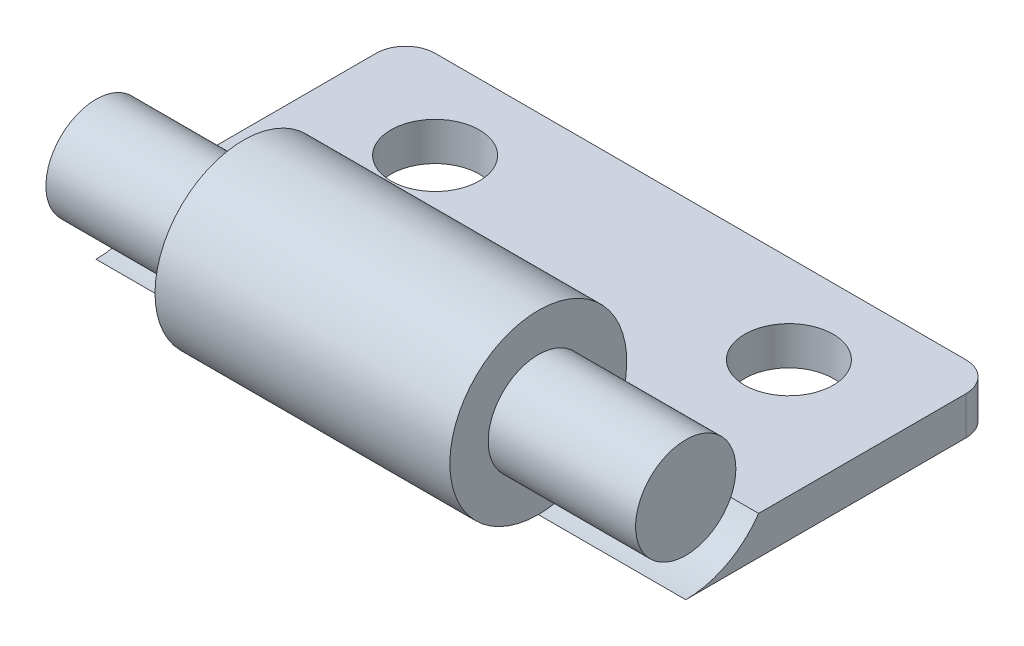
ISO-10303-21;
HEADER;
FILE_DESCRIPTION(('STEP AP214'),'2;1');
FILE_NAME('part.step','',(''),(''),'','','');
FILE_SCHEMA(('AUTOMOTIVE_DESIGN { 1 0 10303 214 1 1 1 1 }'));
ENDSEC;
DATA;
#1=APPLICATION_CONTEXT('core data for automotive mechanical design processes');
#2=APPLICATION_PROTOCOL_DEFINITION('international standard','automotive_design',2000,#1);
#3=PRODUCT_CONTEXT('',#1,'mechanical');
#4=PRODUCT('Part','Part','',(#3));
#5=PRODUCT_RELATED_PRODUCT_CATEGORY('part','',(#4));
#6=PRODUCT_DEFINITION_FORMATION('','',#4);
#7=PRODUCT_DEFINITION_CONTEXT('part definition',#1,'design');
#8=PRODUCT_DEFINITION('design','',#6,#7);
#9=PRODUCT_DEFINITION_SHAPE('','',#8);
#10=(LENGTH_UNIT() NAMED_UNIT(*) SI_UNIT(.MILLI.,.METRE.));
#11=(NAMED_UNIT(*) PLANE_ANGLE_UNIT() SI_UNIT($,.RADIAN.));
#12=(NAMED_UNIT(*) SI_UNIT($,.STERADIAN.) SOLID_ANGLE_UNIT());
#13=UNCERTAINTY_MEASURE_WITH_UNIT(LENGTH_MEASURE(1.E-05),#10,'distance_accuracy_value','');
#14=(GEOMETRIC_REPRESENTATION_CONTEXT(3) GLOBAL_UNCERTAINTY_ASSIGNED_CONTEXT((#13)) GLOBAL_UNIT_ASSIGNED_CONTEXT((#10,
#11,#12)) REPRESENTATION_CONTEXT('',''));
#15=CARTESIAN_POINT('',(0.,0.,0.));
#16=DIRECTION('',(0.,0.,1.));
#17=DIRECTION('',(1.,0.,0.));
#18=AXIS2_PLACEMENT_3D('',#15,#16,#17);
#19=CARTESIAN_POINT('',(10.,1.3,0.));
#20=DIRECTION('',(0.,-1.,0.));
#21=DIRECTION('',(0.,0.,-1.));
#22=AXIS2_PLACEMENT_3D('',#19,#20,#21);
#23=PLANE('',#22);
#24=CARTESIAN_POINT('',(6.,1.3,-7.5));
#25=DIRECTION('',(0.,-1.,0.));
#26=DIRECTION('',(0.,0.,1.));
#27=AXIS2_PLACEMENT_3D('',#24,#25,#26);
#28=CIRCLE('',#27,1.5);
#29=CARTESIAN_POINT('',(6.,1.3,-6.));
#30=VERTEX_POINT('',#29);
#31=EDGE_CURVE('E148',#30,#30,#28,.T.);
#32=ORIENTED_EDGE('',*,*,#31,.T.);
#33=EDGE_LOOP('',(#32));
#34=FACE_BOUND('',#33,.T.);
#35=CARTESIAN_POINT('',(-6.,1.3,-7.5));
#36=DIRECTION('',(0.,1.,0.));
#37=DIRECTION('',(0.,0.,1.));
#38=AXIS2_PLACEMENT_3D('',#35,#36,#37);
#39=CIRCLE('',#38,1.5);
#40=CARTESIAN_POINT('',(-6.,1.3,-6.));
#41=VERTEX_POINT('',#40);
#42=EDGE_CURVE('E144',#41,#41,#39,.T.);
#43=ORIENTED_EDGE('',*,*,#42,.F.);
#44=EDGE_LOOP('',(#43));
#45=FACE_BOUND('',#44,.T.);
#46=DIRECTION('',(-1.,0.,0.));
#47=VECTOR('',#46,1.);
#48=CARTESIAN_POINT('',(10.,1.3,-10.5));
#49=LINE('',#48,#47);
#50=CARTESIAN_POINT('',(9.,1.3,-10.5));
#51=VERTEX_POINT('',#50);
#52=CARTESIAN_POINT('',(-9.,1.3,-10.5));
#53=VERTEX_POINT('',#52);
#54=EDGE_CURVE('E168',#51,#53,#49,.T.);
#55=ORIENTED_EDGE('',*,*,#54,.T.);
#56=CARTESIAN_POINT('',(-9.,1.3,-9.5));
#57=DIRECTION('',(0.,-1.,0.));
#58=DIRECTION('',(0.,0.,-1.));
#59=AXIS2_PLACEMENT_3D('',#56,#57,#58);
#60=CIRCLE('',#59,1.);
#61=CARTESIAN_POINT('',(-10.,1.3,-9.5));
#62=VERTEX_POINT('',#61);
#63=EDGE_CURVE('E155',#53,#62,#60,.F.);
#64=ORIENTED_EDGE('',*,*,#63,.T.);
#65=DIRECTION('',(0.,0.,1.));
#66=VECTOR('',#65,1.);
#67=CARTESIAN_POINT('',(-10.,1.3,0.));
#68=LINE('',#67,#66);
#69=CARTESIAN_POINT('',(-10.,1.3,-2.47184141886166));
#70=VERTEX_POINT('',#69);
#71=EDGE_CURVE('E171',#62,#70,#68,.T.);
#72=ORIENTED_EDGE('',*,*,#71,.T.);
#73=DIRECTION('',(-1.,0.,0.));
#74=VECTOR('',#73,1.);
#75=CARTESIAN_POINT('',(-5.,1.3,-2.47184141886166));
#76=LINE('',#75,#74);
#77=CARTESIAN_POINT('',(-5.,1.3,-2.47184141886166));
#78=VERTEX_POINT('',#77);
#79=EDGE_CURVE('E124',#78,#70,#76,.T.);
#80=ORIENTED_EDGE('',*,*,#79,.F.);
#81=DIRECTION('',(1.,0.,0.));
#82=VECTOR('',#81,1.);
#83=CARTESIAN_POINT('',(-5.,1.3,-2.47184141886166));
#84=LINE('',#83,#82);
#85=CARTESIAN_POINT('',(5.,1.3,-2.47184141886166));
#86=VERTEX_POINT('',#85);
#87=EDGE_CURVE('E131',#78,#86,#84,.T.);
#88=ORIENTED_EDGE('',*,*,#87,.T.);
#89=DIRECTION('',(1.,0.,0.));
#90=VECTOR('',#89,1.);
#91=CARTESIAN_POINT('',(5.,1.3,-2.47184141886166));
#92=LINE('',#91,#90);
#93=CARTESIAN_POINT('',(10.,1.3,-2.47184141886166));
#94=VERTEX_POINT('',#93);
#95=EDGE_CURVE('E177',#86,#94,#92,.T.);
#96=ORIENTED_EDGE('',*,*,#95,.T.);
#97=DIRECTION('',(0.,0.,1.));
#98=VECTOR('',#97,1.);
#99=CARTESIAN_POINT('',(10.,1.3,0.));
#100=LINE('',#99,#98);
#101=CARTESIAN_POINT('',(10.,1.3,-9.5));
#102=VERTEX_POINT('',#101);
#103=EDGE_CURVE('E175',#102,#94,#100,.T.);
#104=ORIENTED_EDGE('',*,*,#103,.F.);
#105=CARTESIAN_POINT('',(9.,1.3,-9.5));
#106=DIRECTION('',(0.,-1.,0.));
#107=DIRECTION('',(0.,0.,-1.));
#108=AXIS2_PLACEMENT_3D('',#105,#106,#107);
#109=CIRCLE('',#108,1.);
#110=EDGE_CURVE('E153',#102,#51,#109,.F.);
#111=ORIENTED_EDGE('',*,*,#110,.T.);
#112=EDGE_LOOP('',(#55,#64,#72,#80,#88,#96,#104,#111));
#113=FACE_BOUND('',#112,.T.);
#114=ADVANCED_FACE('F38',(#34,#45,#113),#23,.F.);
#115=CARTESIAN_POINT('',(10.,0.,0.));
#116=DIRECTION('',(0.,1.,0.));
#117=DIRECTION('',(0.,0.,1.));
#118=AXIS2_PLACEMENT_3D('',#115,#116,#117);
#119=PLANE('',#118);
#120=CARTESIAN_POINT('',(6.,0.,-7.5));
#121=DIRECTION('',(0.,1.,0.));
#122=DIRECTION('',(0.,0.,1.));
#123=AXIS2_PLACEMENT_3D('',#120,#121,#122);
#124=CIRCLE('',#123,1.5);
#125=CARTESIAN_POINT('',(6.,0.,-6.));
#126=VERTEX_POINT('',#125);
#127=EDGE_CURVE('E145',#126,#126,#124,.F.);
#128=ORIENTED_EDGE('',*,*,#127,.F.);
#129=EDGE_LOOP('',(#128));
#130=FACE_BOUND('',#129,.T.);
#131=CARTESIAN_POINT('',(-6.,0.,-7.5));
#132=DIRECTION('',(0.,1.,0.));
#133=DIRECTION('',(0.,0.,1.));
#134=AXIS2_PLACEMENT_3D('',#131,#132,#133);
#135=CIRCLE('',#134,1.5);
#136=CARTESIAN_POINT('',(-6.,0.,-6.));
#137=VERTEX_POINT('',#136);
#138=EDGE_CURVE('E140',#137,#137,#135,.T.);
#139=ORIENTED_EDGE('',*,*,#138,.T.);
#140=EDGE_LOOP('',(#139));
#141=FACE_BOUND('',#140,.T.);
#142=DIRECTION('',(0.,0.,-1.));
#143=VECTOR('',#142,1.);
#144=CARTESIAN_POINT('',(-10.,0.,0.));
#145=LINE('',#144,#143);
#146=CARTESIAN_POINT('',(-10.,0.,0.));
#147=VERTEX_POINT('',#146);
#148=CARTESIAN_POINT('',(-10.,0.,-9.5));
#149=VERTEX_POINT('',#148);
#150=EDGE_CURVE('E160',#147,#149,#145,.T.);
#151=ORIENTED_EDGE('',*,*,#150,.T.);
#152=CARTESIAN_POINT('',(-9.,0.,-9.5));
#153=DIRECTION('',(0.,1.,0.));
#154=DIRECTION('',(0.,0.,1.));
#155=AXIS2_PLACEMENT_3D('',#152,#153,#154);
#156=CIRCLE('',#155,1.);
#157=CARTESIAN_POINT('',(-9.,0.,-10.5));
#158=VERTEX_POINT('',#157);
#159=EDGE_CURVE('E46',#149,#158,#156,.F.);
#160=ORIENTED_EDGE('',*,*,#159,.T.);
#161=DIRECTION('',(-1.,0.,0.));
#162=VECTOR('',#161,1.);
#163=CARTESIAN_POINT('',(10.,0.,-10.5));
#164=LINE('',#163,#162);
#165=CARTESIAN_POINT('',(9.,0.,-10.5));
#166=VERTEX_POINT('',#165);
#167=EDGE_CURVE('E116',#166,#158,#164,.T.);
#168=ORIENTED_EDGE('',*,*,#167,.F.);
#169=CARTESIAN_POINT('',(9.,0.,-9.5));
#170=DIRECTION('',(0.,1.,0.));
#171=DIRECTION('',(0.,0.,1.));
#172=AXIS2_PLACEMENT_3D('',#169,#170,#171);
#173=CIRCLE('',#172,1.);
#174=CARTESIAN_POINT('',(10.,0.,-9.5));
#175=VERTEX_POINT('',#174);
#176=EDGE_CURVE('E53',#166,#175,#173,.F.);
#177=ORIENTED_EDGE('',*,*,#176,.T.);
#178=DIRECTION('',(0.,0.,-1.));
#179=VECTOR('',#178,1.);
#180=CARTESIAN_POINT('',(10.,0.,0.));
#181=LINE('',#180,#179);
#182=CARTESIAN_POINT('',(10.,0.,0.));
#183=VERTEX_POINT('',#182);
#184=EDGE_CURVE('E173',#183,#175,#181,.T.);
#185=ORIENTED_EDGE('',*,*,#184,.F.);
#186=DIRECTION('',(-1.,0.,0.));
#187=VECTOR('',#186,1.);
#188=CARTESIAN_POINT('',(10.,0.,0.));
#189=LINE('',#188,#187);
#190=CARTESIAN_POINT('',(5.,0.,0.));
#191=VERTEX_POINT('',#190);
#192=EDGE_CURVE('E118',#183,#191,#189,.T.);
#193=ORIENTED_EDGE('',*,*,#192,.T.);
#194=CARTESIAN_POINT('',(-5.,0.,0.));
#195=VERTEX_POINT('',#194);
#196=EDGE_CURVE('E115',#191,#195,#189,.T.);
#197=ORIENTED_EDGE('',*,*,#196,.T.);
#198=EDGE_CURVE('E106',#195,#147,#189,.T.);
#199=ORIENTED_EDGE('',*,*,#198,.T.);
#200=EDGE_LOOP('',(#151,#160,#168,#177,#185,#193,#197,#199));
#201=FACE_BOUND('',#200,.T.);
#202=ADVANCED_FACE('F135',(#130,#141,#201),#119,.F.);
#203=CARTESIAN_POINT('',(10.,0.,-10.5));
#204=DIRECTION('',(0.,0.,1.));
#205=DIRECTION('',(1.,0.,0.));
#206=AXIS2_PLACEMENT_3D('',#203,#204,#205);
#207=PLANE('',#206);
#208=ORIENTED_EDGE('',*,*,#167,.T.);
#209=DIRECTION('',(0.,1.,0.));
#210=VECTOR('',#209,1.);
#211=CARTESIAN_POINT('',(-9.,1.3,-10.5));
#212=LINE('',#211,#210);
#213=EDGE_CURVE('E150',#158,#53,#212,.T.);
#214=ORIENTED_EDGE('',*,*,#213,.T.);
#215=ORIENTED_EDGE('',*,*,#54,.F.);
#216=DIRECTION('',(0.,1.,0.));
#217=VECTOR('',#216,1.);
#218=CARTESIAN_POINT('',(9.,0.,-10.5));
#219=LINE('',#218,#217);
#220=EDGE_CURVE('E136',#51,#166,#219,.F.);
#221=ORIENTED_EDGE('',*,*,#220,.T.);
#222=EDGE_LOOP('',(#208,#214,#215,#221));
#223=FACE_BOUND('',#222,.T.);
#224=ADVANCED_FACE('F164',(#223),#207,.F.);
#225=CARTESIAN_POINT('',(10.,0.,0.));
#226=DIRECTION('',(-1.,0.,0.));
#227=DIRECTION('',(0.,0.,1.));
#228=AXIS2_PLACEMENT_3D('',#225,#226,#227);
#229=PLANE('',#228);
#230=ORIENTED_EDGE('',*,*,#184,.T.);
#231=DIRECTION('',(0.,1.,0.));
#232=VECTOR('',#231,1.);
#233=CARTESIAN_POINT('',(10.,0.,-9.5));
#234=LINE('',#233,#232);
#235=EDGE_CURVE('E11',#175,#102,#234,.T.);
#236=ORIENTED_EDGE('',*,*,#235,.T.);
#237=ORIENTED_EDGE('',*,*,#103,.T.);
#238=CARTESIAN_POINT('',(10.,3.,0.));
#239=DIRECTION('',(1.,0.,0.));
#240=DIRECTION('',(0.,0.,-1.));
#241=AXIS2_PLACEMENT_3D('',#238,#239,#240);
#242=CIRCLE('',#241,3.);
#243=EDGE_CURVE('E188',#183,#94,#242,.T.);
#244=ORIENTED_EDGE('',*,*,#243,.F.);
#245=EDGE_LOOP('',(#230,#236,#237,#244));
#246=FACE_BOUND('',#245,.T.);
#247=ADVANCED_FACE('F244',(#246),#229,.F.);
#248=CARTESIAN_POINT('',(-10.,0.,0.));
#249=DIRECTION('',(-1.,0.,0.));
#250=DIRECTION('',(0.,0.,1.));
#251=AXIS2_PLACEMENT_3D('',#248,#249,#250);
#252=PLANE('',#251);
#253=ORIENTED_EDGE('',*,*,#71,.F.);
#254=DIRECTION('',(0.,1.,0.));
#255=VECTOR('',#254,1.);
#256=CARTESIAN_POINT('',(-10.,0.,-9.5));
#257=LINE('',#256,#255);
#258=EDGE_CURVE('E61',#62,#149,#257,.F.);
#259=ORIENTED_EDGE('',*,*,#258,.T.);
#260=ORIENTED_EDGE('',*,*,#150,.F.);
#261=CARTESIAN_POINT('',(-10.,3.,0.));
#262=DIRECTION('',(1.,0.,0.));
#263=DIRECTION('',(0.,0.,-1.));
#264=AXIS2_PLACEMENT_3D('',#261,#262,#263);
#265=CIRCLE('',#264,3.);
#266=EDGE_CURVE('E113',#147,#70,#265,.T.);
#267=ORIENTED_EDGE('',*,*,#266,.T.);
#268=EDGE_LOOP('',(#253,#259,#260,#267));
#269=FACE_BOUND('',#268,.T.);
#270=ADVANCED_FACE('F172',(#269),#252,.T.);
#271=CARTESIAN_POINT('',(5.,3.,0.));
#272=DIRECTION('',(1.,0.,0.));
#273=DIRECTION('',(0.,0.,-1.));
#274=AXIS2_PLACEMENT_3D('',#271,#272,#273);
#275=PLANE('',#274);
#276=CARTESIAN_POINT('',(5.,3.,0.));
#277=DIRECTION('',(1.,0.,0.));
#278=DIRECTION('',(0.,0.,-1.));
#279=AXIS2_PLACEMENT_3D('',#276,#277,#278);
#280=CIRCLE('',#279,1.7);
#281=CARTESIAN_POINT('',(5.,3.,-1.7));
#282=VERTEX_POINT('',#281);
#283=EDGE_CURVE('E195',#282,#282,#280,.T.);
#284=ORIENTED_EDGE('',*,*,#283,.F.);
#285=EDGE_LOOP('',(#284));
#286=FACE_BOUND('',#285,.T.);
#287=CARTESIAN_POINT('',(5.,3.,0.));
#288=DIRECTION('',(1.,0.,0.));
#289=DIRECTION('',(0.,0.,-1.));
#290=AXIS2_PLACEMENT_3D('',#287,#288,#289);
#291=CIRCLE('',#290,3.);
#292=EDGE_CURVE('E132',#86,#191,#291,.T.);
#293=ORIENTED_EDGE('',*,*,#292,.T.);
#294=CARTESIAN_POINT('',(5.,3.,0.));
#295=DIRECTION('',(1.,0.,0.));
#296=DIRECTION('',(0.,0.,-1.));
#297=AXIS2_PLACEMENT_3D('',#294,#295,#296);
#298=CIRCLE('',#297,3.);
#299=EDGE_CURVE('E187',#191,#86,#298,.T.);
#300=ORIENTED_EDGE('',*,*,#299,.T.);
#301=EDGE_LOOP('',(#293,#300));
#302=FACE_BOUND('',#301,.T.);
#303=ADVANCED_FACE('F258',(#286,#302),#275,.T.);
#304=CARTESIAN_POINT('',(5.,3.,0.));
#305=DIRECTION('',(1.,0.,0.));
#306=DIRECTION('',(0.,0.,-1.));
#307=AXIS2_PLACEMENT_3D('',#304,#305,#306);
#308=CYLINDRICAL_SURFACE('',#307,3.);
#309=ORIENTED_EDGE('',*,*,#192,.F.);
#310=ORIENTED_EDGE('',*,*,#243,.T.);
#311=ORIENTED_EDGE('',*,*,#95,.F.);
#312=ORIENTED_EDGE('',*,*,#299,.F.);
#313=EDGE_LOOP('',(#309,#310,#311,#312));
#314=FACE_BOUND('',#313,.T.);
#315=ADVANCED_FACE('F256',(#314),#308,.F.);
#316=CARTESIAN_POINT('',(-5.,3.,0.));
#317=DIRECTION('',(1.,0.,0.));
#318=DIRECTION('',(0.,0.,-1.));
#319=AXIS2_PLACEMENT_3D('',#316,#317,#318);
#320=PLANE('',#319);
#321=CARTESIAN_POINT('',(-5.,3.,0.));
#322=DIRECTION('',(1.,0.,0.));
#323=DIRECTION('',(0.,0.,-1.));
#324=AXIS2_PLACEMENT_3D('',#321,#322,#323);
#325=CIRCLE('',#324,1.7);
#326=CARTESIAN_POINT('',(-5.,3.,-1.7));
#327=VERTEX_POINT('',#326);
#328=EDGE_CURVE('E143',#327,#327,#325,.T.);
#329=ORIENTED_EDGE('',*,*,#328,.T.);
#330=EDGE_LOOP('',(#329));
#331=FACE_BOUND('',#330,.T.);
#332=CARTESIAN_POINT('',(-5.,3.,0.));
#333=DIRECTION('',(1.,0.,0.));
#334=DIRECTION('',(0.,0.,-1.));
#335=AXIS2_PLACEMENT_3D('',#332,#333,#334);
#336=CIRCLE('',#335,3.);
#337=EDGE_CURVE('E110',#195,#78,#336,.T.);
#338=ORIENTED_EDGE('',*,*,#337,.F.);
#339=CARTESIAN_POINT('',(-5.,3.,0.));
#340=DIRECTION('',(1.,0.,0.));
#341=DIRECTION('',(0.,0.,-1.));
#342=AXIS2_PLACEMENT_3D('',#339,#340,#341);
#343=CIRCLE('',#342,3.);
#344=EDGE_CURVE('E123',#78,#195,#343,.T.);
#345=ORIENTED_EDGE('',*,*,#344,.F.);
#346=EDGE_LOOP('',(#338,#345));
#347=FACE_BOUND('',#346,.T.);
#348=ADVANCED_FACE('F122',(#331,#347),#320,.F.);
#349=CARTESIAN_POINT('',(-5.,3.,0.));
#350=DIRECTION('',(1.,0.,0.));
#351=DIRECTION('',(0.,0.,-1.));
#352=AXIS2_PLACEMENT_3D('',#349,#350,#351);
#353=CYLINDRICAL_SURFACE('',#352,3.);
#354=ORIENTED_EDGE('',*,*,#344,.T.);
#355=ORIENTED_EDGE('',*,*,#196,.F.);
#356=ORIENTED_EDGE('',*,*,#292,.F.);
#357=ORIENTED_EDGE('',*,*,#87,.F.);
#358=EDGE_LOOP('',(#354,#355,#356,#357));
#359=FACE_BOUND('',#358,.T.);
#360=ADVANCED_FACE('F128',(#359),#353,.T.);
#361=CARTESIAN_POINT('',(10.,3.,0.));
#362=DIRECTION('',(-1.,0.,0.));
#363=DIRECTION('',(0.,0.,1.));
#364=AXIS2_PLACEMENT_3D('',#361,#362,#363);
#365=CYLINDRICAL_SURFACE('',#364,1.7);
#366=CARTESIAN_POINT('',(10.,3.,0.));
#367=DIRECTION('',(1.,0.,0.));
#368=DIRECTION('',(0.,0.,-1.));
#369=AXIS2_PLACEMENT_3D('',#366,#367,#368);
#370=CIRCLE('',#369,1.7);
#371=CARTESIAN_POINT('',(10.,3.,-1.7));
#372=VERTEX_POINT('',#371);
#373=EDGE_CURVE('E193',#372,#372,#370,.T.);
#374=ORIENTED_EDGE('',*,*,#373,.F.);
#375=EDGE_LOOP('',(#374));
#376=FACE_BOUND('',#375,.T.);
#377=ORIENTED_EDGE('',*,*,#283,.T.);
#378=EDGE_LOOP('',(#377));
#379=FACE_BOUND('',#378,.T.);
#380=ADVANCED_FACE('F346',(#376,#379),#365,.T.);
#381=CARTESIAN_POINT('',(10.,3.,0.));
#382=DIRECTION('',(1.,0.,0.));
#383=DIRECTION('',(0.,0.,-1.));
#384=AXIS2_PLACEMENT_3D('',#381,#382,#383);
#385=PLANE('',#384);
#386=ORIENTED_EDGE('',*,*,#373,.T.);
#387=EDGE_LOOP('',(#386));
#388=FACE_BOUND('',#387,.T.);
#389=ADVANCED_FACE('F320',(#388),#385,.T.);
#390=CARTESIAN_POINT('',(-5.,3.,0.));
#391=DIRECTION('',(-1.,0.,0.));
#392=DIRECTION('',(0.,0.,1.));
#393=AXIS2_PLACEMENT_3D('',#390,#391,#392);
#394=CYLINDRICAL_SURFACE('',#393,3.);
#395=ORIENTED_EDGE('',*,*,#198,.F.);
#396=ORIENTED_EDGE('',*,*,#337,.T.);
#397=ORIENTED_EDGE('',*,*,#79,.T.);
#398=ORIENTED_EDGE('',*,*,#266,.F.);
#399=EDGE_LOOP('',(#395,#396,#397,#398));
#400=FACE_BOUND('',#399,.T.);
#401=ADVANCED_FACE('F108',(#400),#394,.F.);
#402=CARTESIAN_POINT('',(-10.,3.,0.));
#403=DIRECTION('',(1.,0.,0.));
#404=DIRECTION('',(0.,0.,-1.));
#405=AXIS2_PLACEMENT_3D('',#402,#403,#404);
#406=CYLINDRICAL_SURFACE('',#405,1.7);
#407=CARTESIAN_POINT('',(-10.,3.,0.));
#408=DIRECTION('',(1.,0.,0.));
#409=DIRECTION('',(0.,0.,-1.));
#410=AXIS2_PLACEMENT_3D('',#407,#408,#409);
#411=CIRCLE('',#410,1.7);
#412=CARTESIAN_POINT('',(-10.,3.,-1.7));
#413=VERTEX_POINT('',#412);
#414=EDGE_CURVE('E201',#413,#413,#411,.T.);
#415=ORIENTED_EDGE('',*,*,#414,.T.);
#416=EDGE_LOOP('',(#415));
#417=FACE_BOUND('',#416,.T.);
#418=ORIENTED_EDGE('',*,*,#328,.F.);
#419=EDGE_LOOP('',(#418));
#420=FACE_BOUND('',#419,.T.);
#421=ADVANCED_FACE('F233',(#417,#420),#406,.T.);
#422=CARTESIAN_POINT('',(-10.,3.,0.));
#423=DIRECTION('',(-1.,0.,0.));
#424=DIRECTION('',(0.,0.,-1.));
#425=AXIS2_PLACEMENT_3D('',#422,#423,#424);
#426=PLANE('',#425);
#427=ORIENTED_EDGE('',*,*,#414,.F.);
#428=EDGE_LOOP('',(#427));
#429=FACE_BOUND('',#428,.T.);
#430=ADVANCED_FACE('F227',(#429),#426,.T.);
#431=CARTESIAN_POINT('',(-6.,-3.7,-7.5));
#432=DIRECTION('',(0.,1.,0.));
#433=DIRECTION('',(0.,0.,1.));
#434=AXIS2_PLACEMENT_3D('',#431,#432,#433);
#435=CYLINDRICAL_SURFACE('',#434,1.5);
#436=ORIENTED_EDGE('',*,*,#42,.T.);
#437=EDGE_LOOP('',(#436));
#438=FACE_BOUND('',#437,.T.);
#439=ORIENTED_EDGE('',*,*,#138,.F.);
#440=EDGE_LOOP('',(#439));
#441=FACE_BOUND('',#440,.T.);
#442=ADVANCED_FACE('F217',(#438,#441),#435,.F.);
#443=CARTESIAN_POINT('',(6.,-3.7,-7.5));
#444=DIRECTION('',(0.,1.,0.));
#445=DIRECTION('',(0.,0.,1.));
#446=AXIS2_PLACEMENT_3D('',#443,#444,#445);
#447=CYLINDRICAL_SURFACE('',#446,1.5);
#448=ORIENTED_EDGE('',*,*,#31,.F.);
#449=EDGE_LOOP('',(#448));
#450=FACE_BOUND('',#449,.T.);
#451=ORIENTED_EDGE('',*,*,#127,.T.);
#452=EDGE_LOOP('',(#451));
#453=FACE_BOUND('',#452,.T.);
#454=ADVANCED_FACE('F214',(#450,#453),#447,.F.);
#455=CARTESIAN_POINT('',(-9.,0.,-9.5));
#456=DIRECTION('',(0.,-1.,0.));
#457=DIRECTION('',(0.,0.,-1.));
#458=AXIS2_PLACEMENT_3D('',#455,#456,#457);
#459=CYLINDRICAL_SURFACE('',#458,1.);
#460=ORIENTED_EDGE('',*,*,#159,.F.);
#461=ORIENTED_EDGE('',*,*,#258,.F.);
#462=ORIENTED_EDGE('',*,*,#63,.F.);
#463=ORIENTED_EDGE('',*,*,#213,.F.);
#464=EDGE_LOOP('',(#460,#461,#462,#463));
#465=FACE_BOUND('',#464,.T.);
#466=ADVANCED_FACE('F169',(#465),#459,.T.);
#467=CARTESIAN_POINT('',(9.,0.,-9.5));
#468=DIRECTION('',(0.,1.,0.));
#469=DIRECTION('',(0.,0.,1.));
#470=AXIS2_PLACEMENT_3D('',#467,#468,#469);
#471=CYLINDRICAL_SURFACE('',#470,1.);
#472=ORIENTED_EDGE('',*,*,#176,.F.);
#473=ORIENTED_EDGE('',*,*,#220,.F.);
#474=ORIENTED_EDGE('',*,*,#110,.F.);
#475=ORIENTED_EDGE('',*,*,#235,.F.);
#476=EDGE_LOOP('',(#472,#473,#474,#475));
#477=FACE_BOUND('',#476,.T.);
#478=ADVANCED_FACE('F40',(#477),#471,.T.);
#479=CLOSED_SHELL('',(#114,#202,#224,#247,#270,#303,#315,#348,#360,#380,#389,#401,#421,#430,
#442,#454,#466,#478));
#480=MANIFOLD_SOLID_BREP('B2',#479);
#481=ADVANCED_BREP_SHAPE_REPRESENTATION('',(#18,#480),#14);
#482=SHAPE_DEFINITION_REPRESENTATION(#9,#481);
ENDSEC;
END-ISO-10303-21;
